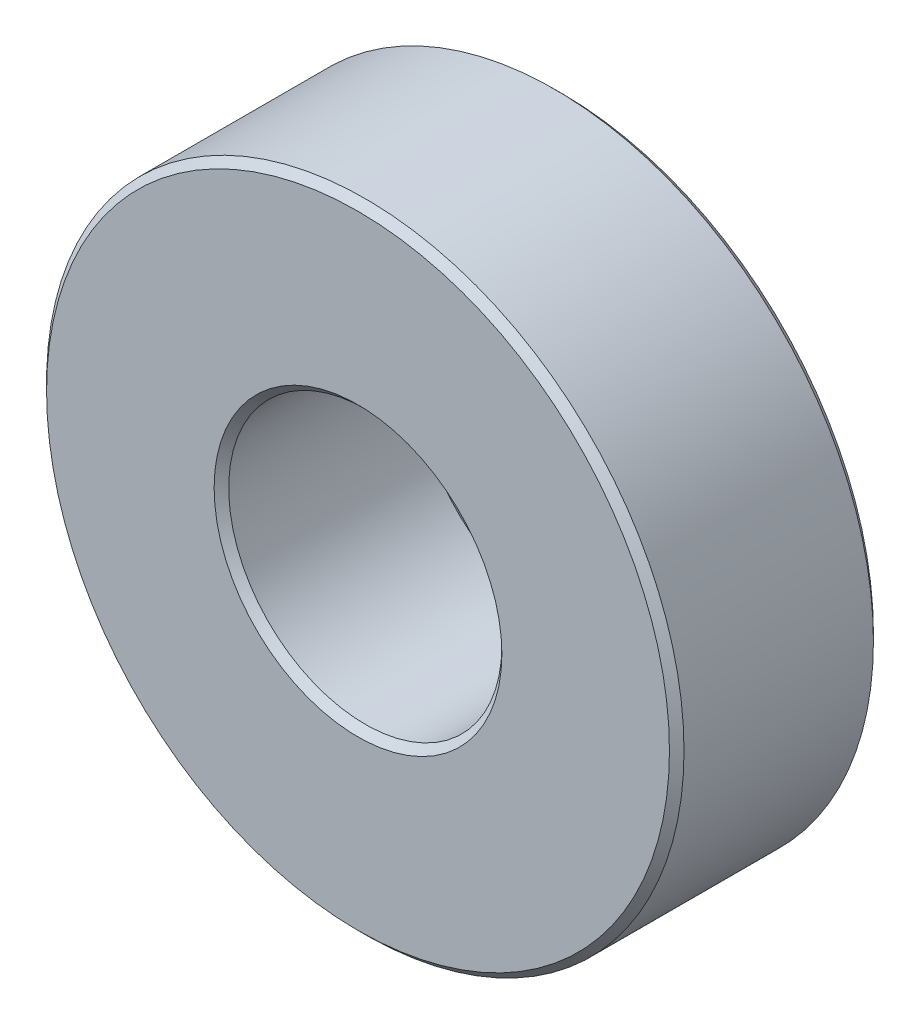
ISO-10303-21;
HEADER;
FILE_DESCRIPTION(('STEP AP214'),'2;1');
FILE_NAME('part.step','',(''),(''),'','','');
FILE_SCHEMA(('AUTOMOTIVE_DESIGN { 1 0 10303 214 1 1 1 1 }'));
ENDSEC;
DATA;
#1=APPLICATION_CONTEXT('core data for automotive mechanical design processes');
#2=APPLICATION_PROTOCOL_DEFINITION('international standard','automotive_design',2000,#1);
#3=PRODUCT_CONTEXT('',#1,'mechanical');
#4=PRODUCT('Part','Part','',(#3));
#5=PRODUCT_RELATED_PRODUCT_CATEGORY('part','',(#4));
#6=PRODUCT_DEFINITION_FORMATION('','',#4);
#7=PRODUCT_DEFINITION_CONTEXT('part definition',#1,'design');
#8=PRODUCT_DEFINITION('design','',#6,#7);
#9=PRODUCT_DEFINITION_SHAPE('','',#8);
#10=(LENGTH_UNIT() NAMED_UNIT(*) SI_UNIT(.MILLI.,.METRE.));
#11=(NAMED_UNIT(*) PLANE_ANGLE_UNIT() SI_UNIT($,.RADIAN.));
#12=(NAMED_UNIT(*) SI_UNIT($,.STERADIAN.) SOLID_ANGLE_UNIT());
#13=UNCERTAINTY_MEASURE_WITH_UNIT(LENGTH_MEASURE(1.E-05),#10,'distance_accuracy_value','');
#14=(GEOMETRIC_REPRESENTATION_CONTEXT(3) GLOBAL_UNCERTAINTY_ASSIGNED_CONTEXT((#13)) GLOBAL_UNIT_ASSIGNED_CONTEXT((#10,
#11,#12)) REPRESENTATION_CONTEXT('',''));
#15=CARTESIAN_POINT('',(0.,0.,0.));
#16=DIRECTION('',(0.,0.,1.));
#17=DIRECTION('',(1.,0.,0.));
#18=AXIS2_PLACEMENT_3D('',#15,#16,#17);
#19=CARTESIAN_POINT('',(11.1125000000316,0.,0.));
#20=DIRECTION('',(0.,0.,-1.));
#21=DIRECTION('',(-1.,0.,0.));
#22=AXIS2_PLACEMENT_3D('',#19,#20,#21);
#23=PLANE('',#22);
#24=CARTESIAN_POINT('',(0.,0.,0.));
#25=DIRECTION('',(0.,0.,-1.));
#26=DIRECTION('',(-1.,0.,0.));
#27=AXIS2_PLACEMENT_3D('',#24,#25,#26);
#28=CIRCLE('',#27,10.8585000000316);
#29=CARTESIAN_POINT('',(-10.8585000000316,0.,0.));
#30=VERTEX_POINT('',#29);
#31=EDGE_CURVE('E50',#30,#30,#28,.T.);
#32=ORIENTED_EDGE('',*,*,#31,.T.);
#33=EDGE_LOOP('',(#32));
#34=FACE_BOUND('',#33,.T.);
#35=CARTESIAN_POINT('',(0.,0.,0.));
#36=DIRECTION('',(0.,0.,-1.));
#37=DIRECTION('',(-1.,0.,0.));
#38=AXIS2_PLACEMENT_3D('',#35,#36,#37);
#39=CIRCLE('',#38,5.01650000008349);
#40=CARTESIAN_POINT('',(-5.01650000008349,0.,0.));
#41=VERTEX_POINT('',#40);
#42=EDGE_CURVE('E53',#41,#41,#39,.F.);
#43=ORIENTED_EDGE('',*,*,#42,.T.);
#44=EDGE_LOOP('',(#43));
#45=FACE_BOUND('',#44,.T.);
#46=ADVANCED_FACE('F30',(#34,#45),#23,.T.);
#47=CARTESIAN_POINT('',(0.,0.,0.));
#48=DIRECTION('',(0.,0.,1.));
#49=DIRECTION('',(1.,0.,0.));
#50=AXIS2_PLACEMENT_3D('',#47,#48,#49);
#51=CYLINDRICAL_SURFACE('',#50,4.76250000008348);
#52=CARTESIAN_POINT('',(0.,0.,0.254000000000006));
#53=DIRECTION('',(0.,0.,-1.));
#54=DIRECTION('',(-1.,0.,0.));
#55=AXIS2_PLACEMENT_3D('',#52,#53,#54);
#56=CIRCLE('',#55,4.76250000008348);
#57=CARTESIAN_POINT('',(-4.76250000008348,0.,0.254000000000006));
#58=VERTEX_POINT('',#57);
#59=EDGE_CURVE('E41',#58,#58,#56,.T.);
#60=ORIENTED_EDGE('',*,*,#59,.T.);
#61=EDGE_LOOP('',(#60));
#62=FACE_BOUND('',#61,.T.);
#63=CARTESIAN_POINT('',(0.,0.,6.8579999999748));
#64=DIRECTION('',(0.,0.,1.));
#65=DIRECTION('',(1.,0.,0.));
#66=AXIS2_PLACEMENT_3D('',#63,#64,#65);
#67=CIRCLE('',#66,4.76250000008348);
#68=CARTESIAN_POINT('',(4.76250000008349,0.,6.8579999999748));
#69=VERTEX_POINT('',#68);
#70=EDGE_CURVE('E45',#69,#69,#67,.T.);
#71=ORIENTED_EDGE('',*,*,#70,.T.);
#72=EDGE_LOOP('',(#71));
#73=FACE_BOUND('',#72,.T.);
#74=ADVANCED_FACE('F74',(#62,#73),#51,.F.);
#75=CARTESIAN_POINT('',(4.76250000008349,0.,7.1119999999748));
#76=DIRECTION('',(0.,0.,1.));
#77=DIRECTION('',(1.,0.,0.));
#78=AXIS2_PLACEMENT_3D('',#75,#76,#77);
#79=PLANE('',#78);
#80=CARTESIAN_POINT('',(0.,0.,7.1119999999748));
#81=DIRECTION('',(0.,0.,1.));
#82=DIRECTION('',(1.,0.,0.));
#83=AXIS2_PLACEMENT_3D('',#80,#81,#82);
#84=CIRCLE('',#83,5.01650000008348);
#85=CARTESIAN_POINT('',(5.01650000008349,0.,7.1119999999748));
#86=VERTEX_POINT('',#85);
#87=EDGE_CURVE('E10',#86,#86,#84,.F.);
#88=ORIENTED_EDGE('',*,*,#87,.T.);
#89=EDGE_LOOP('',(#88));
#90=FACE_BOUND('',#89,.T.);
#91=CARTESIAN_POINT('',(0.,0.,7.1119999999748));
#92=DIRECTION('',(0.,0.,1.));
#93=DIRECTION('',(1.,0.,0.));
#94=AXIS2_PLACEMENT_3D('',#91,#92,#93);
#95=CIRCLE('',#94,10.8585000000316);
#96=CARTESIAN_POINT('',(10.8585000000316,0.,7.1119999999748));
#97=VERTEX_POINT('',#96);
#98=EDGE_CURVE('E37',#97,#97,#95,.T.);
#99=ORIENTED_EDGE('',*,*,#98,.T.);
#100=EDGE_LOOP('',(#99));
#101=FACE_BOUND('',#100,.T.);
#102=ADVANCED_FACE('F80',(#90,#101),#79,.T.);
#103=CARTESIAN_POINT('',(0.,0.,0.));
#104=DIRECTION('',(0.,0.,1.));
#105=DIRECTION('',(1.,0.,0.));
#106=AXIS2_PLACEMENT_3D('',#103,#104,#105);
#107=CYLINDRICAL_SURFACE('',#106,11.1125000000316);
#108=CARTESIAN_POINT('',(0.,0.,0.254000000000001));
#109=DIRECTION('',(0.,0.,-1.));
#110=DIRECTION('',(-1.,0.,0.));
#111=AXIS2_PLACEMENT_3D('',#108,#109,#110);
#112=CIRCLE('',#111,11.1125000000316);
#113=CARTESIAN_POINT('',(-11.1125000000316,0.,0.254000000000001));
#114=VERTEX_POINT('',#113);
#115=EDGE_CURVE('E56',#114,#114,#112,.F.);
#116=ORIENTED_EDGE('',*,*,#115,.T.);
#117=EDGE_LOOP('',(#116));
#118=FACE_BOUND('',#117,.T.);
#119=CARTESIAN_POINT('',(0.,0.,6.85799999997479));
#120=DIRECTION('',(0.,0.,1.));
#121=DIRECTION('',(1.,0.,0.));
#122=AXIS2_PLACEMENT_3D('',#119,#120,#121);
#123=CIRCLE('',#122,11.1125000000316);
#124=CARTESIAN_POINT('',(11.1125000000316,0.,6.85799999997479));
#125=VERTEX_POINT('',#124);
#126=EDGE_CURVE('E59',#125,#125,#123,.F.);
#127=ORIENTED_EDGE('',*,*,#126,.T.);
#128=EDGE_LOOP('',(#127));
#129=FACE_BOUND('',#128,.T.);
#130=ADVANCED_FACE('F63',(#118,#129),#107,.T.);
#131=CARTESIAN_POINT('',(0.,0.,0.254000000000001));
#132=DIRECTION('',(0.,0.,1.));
#133=DIRECTION('',(1.,0.,0.));
#134=AXIS2_PLACEMENT_3D('',#131,#132,#133);
#135=CONICAL_SURFACE('',#134,11.1125000000316,0.785398163397448);
#136=ORIENTED_EDGE('',*,*,#31,.F.);
#137=EDGE_LOOP('',(#136));
#138=FACE_BOUND('',#137,.T.);
#139=ORIENTED_EDGE('',*,*,#115,.F.);
#140=EDGE_LOOP('',(#139));
#141=FACE_BOUND('',#140,.T.);
#142=ADVANCED_FACE('F86',(#138,#141),#135,.T.);
#143=CARTESIAN_POINT('',(0.,0.,0.));
#144=DIRECTION('',(0.,0.,-1.));
#145=DIRECTION('',(-1.,0.,0.));
#146=AXIS2_PLACEMENT_3D('',#143,#144,#145);
#147=CONICAL_SURFACE('',#146,5.01650000008349,0.785398163397452);
#148=ORIENTED_EDGE('',*,*,#59,.F.);
#149=EDGE_LOOP('',(#148));
#150=FACE_BOUND('',#149,.T.);
#151=ORIENTED_EDGE('',*,*,#42,.F.);
#152=EDGE_LOOP('',(#151));
#153=FACE_BOUND('',#152,.T.);
#154=ADVANCED_FACE('F71',(#150,#153),#147,.F.);
#155=CARTESIAN_POINT('',(0.,0.,6.8579999999748));
#156=DIRECTION('',(0.,0.,1.));
#157=DIRECTION('',(1.,0.,0.));
#158=AXIS2_PLACEMENT_3D('',#155,#156,#157);
#159=CONICAL_SURFACE('',#158,4.76250000008348,0.785398163397443);
#160=ORIENTED_EDGE('',*,*,#87,.F.);
#161=EDGE_LOOP('',(#160));
#162=FACE_BOUND('',#161,.T.);
#163=ORIENTED_EDGE('',*,*,#70,.F.);
#164=EDGE_LOOP('',(#163));
#165=FACE_BOUND('',#164,.T.);
#166=ADVANCED_FACE('F67',(#162,#165),#159,.F.);
#167=CARTESIAN_POINT('',(0.,0.,7.1119999999748));
#168=DIRECTION('',(0.,0.,-1.));
#169=DIRECTION('',(-1.,0.,0.));
#170=AXIS2_PLACEMENT_3D('',#167,#168,#169);
#171=CONICAL_SURFACE('',#170,10.8585000000316,0.785398163397438);
#172=ORIENTED_EDGE('',*,*,#126,.F.);
#173=EDGE_LOOP('',(#172));
#174=FACE_BOUND('',#173,.T.);
#175=ORIENTED_EDGE('',*,*,#98,.F.);
#176=EDGE_LOOP('',(#175));
#177=FACE_BOUND('',#176,.T.);
#178=ADVANCED_FACE('F32',(#174,#177),#171,.T.);
#179=CLOSED_SHELL('',(#46,#74,#102,#130,#142,#154,#166,#178));
#180=MANIFOLD_SOLID_BREP('B2',#179);
#181=ADVANCED_BREP_SHAPE_REPRESENTATION('',(#18,#180),#14);
#182=SHAPE_DEFINITION_REPRESENTATION(#9,#181);
ENDSEC;
END-ISO-10303-21;
